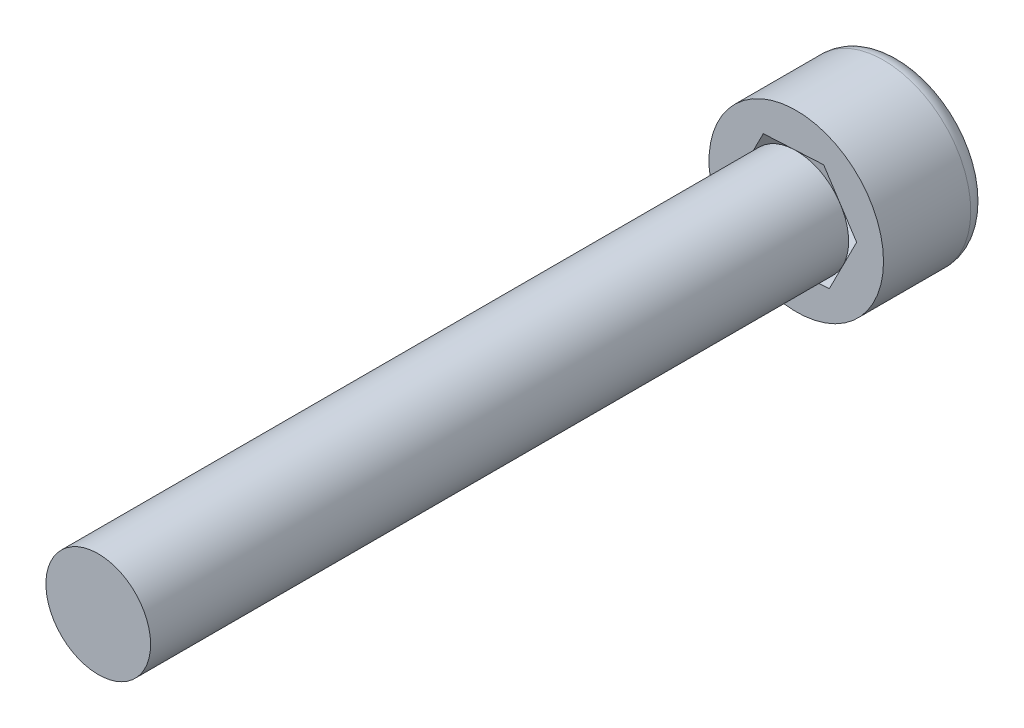
ISO-10303-21;
HEADER;
FILE_DESCRIPTION(('STEP AP214'),'2;1');
FILE_NAME('part.step','',(''),(''),'','','');
FILE_SCHEMA(('AUTOMOTIVE_DESIGN { 1 0 10303 214 1 1 1 1 }'));
ENDSEC;
DATA;
#1=APPLICATION_CONTEXT('core data for automotive mechanical design processes');
#2=APPLICATION_PROTOCOL_DEFINITION('international standard','automotive_design',2000,#1);
#3=PRODUCT_CONTEXT('',#1,'mechanical');
#4=PRODUCT('Part','Part','',(#3));
#5=PRODUCT_RELATED_PRODUCT_CATEGORY('part','',(#4));
#6=PRODUCT_DEFINITION_FORMATION('','',#4);
#7=PRODUCT_DEFINITION_CONTEXT('part definition',#1,'design');
#8=PRODUCT_DEFINITION('design','',#6,#7);
#9=PRODUCT_DEFINITION_SHAPE('','',#8);
#10=(LENGTH_UNIT() NAMED_UNIT(*) SI_UNIT(.MILLI.,.METRE.));
#11=(NAMED_UNIT(*) PLANE_ANGLE_UNIT() SI_UNIT($,.RADIAN.));
#12=(NAMED_UNIT(*) SI_UNIT($,.STERADIAN.) SOLID_ANGLE_UNIT());
#13=UNCERTAINTY_MEASURE_WITH_UNIT(LENGTH_MEASURE(1.E-05),#10,'distance_accuracy_value','');
#14=(GEOMETRIC_REPRESENTATION_CONTEXT(3) GLOBAL_UNCERTAINTY_ASSIGNED_CONTEXT((#13)) GLOBAL_UNIT_ASSIGNED_CONTEXT((#10,
#11,#12)) REPRESENTATION_CONTEXT('',''));
#15=CARTESIAN_POINT('',(0.,0.,0.));
#16=DIRECTION('',(0.,0.,1.));
#17=DIRECTION('',(1.,0.,0.));
#18=AXIS2_PLACEMENT_3D('',#15,#16,#17);
#19=CARTESIAN_POINT('',(0.,0.,3.));
#20=DIRECTION('',(0.,0.,-1.));
#21=DIRECTION('',(-1.,0.,0.));
#22=AXIS2_PLACEMENT_3D('',#19,#20,#21);
#23=CYLINDRICAL_SURFACE('',#22,2.5);
#24=CARTESIAN_POINT('',(0.,0.,0.5));
#25=DIRECTION('',(0.,0.,1.));
#26=DIRECTION('',(1.,0.,0.));
#27=AXIS2_PLACEMENT_3D('',#24,#25,#26);
#28=CIRCLE('',#27,2.5);
#29=CARTESIAN_POINT('',(2.5,0.,0.5));
#30=VERTEX_POINT('',#29);
#31=EDGE_CURVE('E50',#30,#30,#28,.T.);
#32=ORIENTED_EDGE('',*,*,#31,.T.);
#33=EDGE_LOOP('',(#32));
#34=FACE_BOUND('',#33,.T.);
#35=CARTESIAN_POINT('',(0.,0.,3.));
#36=DIRECTION('',(0.,0.,1.));
#37=DIRECTION('',(1.,0.,0.));
#38=AXIS2_PLACEMENT_3D('',#35,#36,#37);
#39=CIRCLE('',#38,2.5);
#40=CARTESIAN_POINT('',(2.5,0.,3.));
#41=VERTEX_POINT('',#40);
#42=EDGE_CURVE('E165',#41,#41,#39,.T.);
#43=ORIENTED_EDGE('',*,*,#42,.F.);
#44=EDGE_LOOP('',(#43));
#45=FACE_BOUND('',#44,.T.);
#46=ADVANCED_FACE('F41',(#34,#45),#23,.T.);
#47=CARTESIAN_POINT('',(0.,0.,3.));
#48=DIRECTION('',(0.,0.,1.));
#49=DIRECTION('',(1.,0.,0.));
#50=AXIS2_PLACEMENT_3D('',#47,#48,#49);
#51=PLANE('',#50);
#52=DIRECTION('',(-0.998565318577122,-0.0535472178079434,0.));
#53=VECTOR('',#52,1.);
#54=CARTESIAN_POINT('',(0.945103759937804,-1.45147472694203,3.));
#55=LINE('',#54,#53);
#56=CARTESIAN_POINT('',(0.945103759937804,-1.45147472694203,3.));
#57=VERTEX_POINT('',#56);
#58=CARTESIAN_POINT('',(-0.784462106513973,-1.54422122878934,3.));
#59=VERTEX_POINT('',#58);
#60=EDGE_CURVE('E94',#57,#59,#55,.T.);
#61=ORIENTED_EDGE('',*,*,#60,.T.);
#62=DIRECTION('',(-0.545655910212218,0.838009324321917,0.));
#63=VECTOR('',#62,1.);
#64=CARTESIAN_POINT('',(-0.784462106513973,-1.54422122878934,3.));
#65=LINE('',#64,#63);
#66=CARTESIAN_POINT('',(-1.72956586645178,-0.0927465018473138,3.));
#67=VERTEX_POINT('',#66);
#68=EDGE_CURVE('E57',#59,#67,#65,.T.);
#69=ORIENTED_EDGE('',*,*,#68,.T.);
#70=DIRECTION('',(0.452909408364904,0.89155654212986,0.));
#71=VECTOR('',#70,1.);
#72=CARTESIAN_POINT('',(-1.72956586645178,-0.0927465018473138,3.));
#73=LINE('',#72,#71);
#74=CARTESIAN_POINT('',(-0.945103759937803,1.45147472694203,3.));
#75=VERTEX_POINT('',#74);
#76=EDGE_CURVE('E104',#67,#75,#73,.T.);
#77=ORIENTED_EDGE('',*,*,#76,.T.);
#78=DIRECTION('',(0.998565318577122,0.0535472178079431,0.));
#79=VECTOR('',#78,1.);
#80=CARTESIAN_POINT('',(-0.945103759937803,1.45147472694203,3.));
#81=LINE('',#80,#79);
#82=CARTESIAN_POINT('',(0.784462106513974,1.54422122878934,3.));
#83=VERTEX_POINT('',#82);
#84=EDGE_CURVE('E176',#75,#83,#81,.T.);
#85=ORIENTED_EDGE('',*,*,#84,.T.);
#86=DIRECTION('',(0.545655910212218,-0.838009324321917,0.));
#87=VECTOR('',#86,1.);
#88=CARTESIAN_POINT('',(0.784462106513974,1.54422122878934,3.));
#89=LINE('',#88,#87);
#90=CARTESIAN_POINT('',(1.72956586645178,0.0927465018473145,3.));
#91=VERTEX_POINT('',#90);
#92=EDGE_CURVE('E174',#83,#91,#89,.T.);
#93=ORIENTED_EDGE('',*,*,#92,.T.);
#94=DIRECTION('',(-0.452909408364904,-0.89155654212986,0.));
#95=VECTOR('',#94,1.);
#96=CARTESIAN_POINT('',(1.72956586645178,0.0927465018473145,3.));
#97=LINE('',#96,#95);
#98=EDGE_CURVE('E109',#91,#57,#97,.T.);
#99=ORIENTED_EDGE('',*,*,#98,.T.);
#100=EDGE_LOOP('',(#61,#69,#77,#85,#93,#99));
#101=FACE_BOUND('',#100,.T.);
#102=ORIENTED_EDGE('',*,*,#42,.T.);
#103=EDGE_LOOP('',(#102));
#104=FACE_BOUND('',#103,.T.);
#105=ADVANCED_FACE('F106',(#101,#104),#51,.T.);
#106=CARTESIAN_POINT('',(0.,0.,0.));
#107=DIRECTION('',(0.,0.,1.));
#108=DIRECTION('',(1.,0.,0.));
#109=AXIS2_PLACEMENT_3D('',#106,#107,#108);
#110=PLANE('',#109);
#111=CARTESIAN_POINT('',(0.,0.,0.));
#112=DIRECTION('',(0.,0.,1.));
#113=DIRECTION('',(1.,0.,0.));
#114=AXIS2_PLACEMENT_3D('',#111,#112,#113);
#115=CIRCLE('',#114,2.);
#116=CARTESIAN_POINT('',(2.,0.,0.));
#117=VERTEX_POINT('',#116);
#118=EDGE_CURVE('E12',#117,#117,#115,.F.);
#119=ORIENTED_EDGE('',*,*,#118,.T.);
#120=EDGE_LOOP('',(#119));
#121=FACE_BOUND('',#120,.T.);
#122=DIRECTION('',(-0.545655910212218,0.838009324321917,0.));
#123=VECTOR('',#122,1.);
#124=CARTESIAN_POINT('',(-0.784462106513973,-1.54422122878934,0.));
#125=LINE('',#124,#123);
#126=CARTESIAN_POINT('',(-0.784462106513973,-1.54422122878934,0.));
#127=VERTEX_POINT('',#126);
#128=CARTESIAN_POINT('',(-1.72956586645178,-0.0927465018473138,0.));
#129=VERTEX_POINT('',#128);
#130=EDGE_CURVE('E99',#127,#129,#125,.T.);
#131=ORIENTED_EDGE('',*,*,#130,.F.);
#132=DIRECTION('',(-0.998565318577122,-0.0535472178079434,0.));
#133=VECTOR('',#132,1.);
#134=CARTESIAN_POINT('',(0.945103759937804,-1.45147472694203,0.));
#135=LINE('',#134,#133);
#136=CARTESIAN_POINT('',(0.945103759937804,-1.45147472694203,0.));
#137=VERTEX_POINT('',#136);
#138=EDGE_CURVE('E90',#137,#127,#135,.T.);
#139=ORIENTED_EDGE('',*,*,#138,.F.);
#140=DIRECTION('',(-0.452909408364904,-0.89155654212986,0.));
#141=VECTOR('',#140,1.);
#142=CARTESIAN_POINT('',(1.72956586645178,0.0927465018473145,0.));
#143=LINE('',#142,#141);
#144=CARTESIAN_POINT('',(1.72956586645178,0.0927465018473145,0.));
#145=VERTEX_POINT('',#144);
#146=EDGE_CURVE('E156',#145,#137,#143,.T.);
#147=ORIENTED_EDGE('',*,*,#146,.F.);
#148=DIRECTION('',(0.545655910212218,-0.838009324321917,0.));
#149=VECTOR('',#148,1.);
#150=CARTESIAN_POINT('',(0.784462106513974,1.54422122878934,0.));
#151=LINE('',#150,#149);
#152=CARTESIAN_POINT('',(0.784462106513974,1.54422122878934,0.));
#153=VERTEX_POINT('',#152);
#154=EDGE_CURVE('E189',#153,#145,#151,.T.);
#155=ORIENTED_EDGE('',*,*,#154,.F.);
#156=DIRECTION('',(0.998565318577122,0.0535472178079431,0.));
#157=VECTOR('',#156,1.);
#158=CARTESIAN_POINT('',(-0.945103759937803,1.45147472694203,0.));
#159=LINE('',#158,#157);
#160=CARTESIAN_POINT('',(-0.945103759937803,1.45147472694203,0.));
#161=VERTEX_POINT('',#160);
#162=EDGE_CURVE('E185',#161,#153,#159,.T.);
#163=ORIENTED_EDGE('',*,*,#162,.F.);
#164=DIRECTION('',(0.452909408364904,0.89155654212986,0.));
#165=VECTOR('',#164,1.);
#166=CARTESIAN_POINT('',(-1.72956586645178,-0.0927465018473138,0.));
#167=LINE('',#166,#165);
#168=EDGE_CURVE('E182',#129,#161,#167,.T.);
#169=ORIENTED_EDGE('',*,*,#168,.F.);
#170=EDGE_LOOP('',(#131,#139,#147,#155,#163,#169));
#171=FACE_BOUND('',#170,.T.);
#172=ADVANCED_FACE('F131',(#121,#171),#110,.F.);
#173=CARTESIAN_POINT('',(0.945103759937804,-1.45147472694203,3.));
#174=DIRECTION('',(0.0535472178079434,-0.998565318577122,0.));
#175=DIRECTION('',(0.998565318577122,0.0535472178079434,0.));
#176=AXIS2_PLACEMENT_3D('',#173,#174,#175);
#177=PLANE('',#176);
#178=ORIENTED_EDGE('',*,*,#138,.T.);
#179=DIRECTION('',(0.,0.,-1.));
#180=VECTOR('',#179,1.);
#181=CARTESIAN_POINT('',(-0.784462106513973,-1.54422122878934,3.));
#182=LINE('',#181,#180);
#183=EDGE_CURVE('E92',#59,#127,#182,.T.);
#184=ORIENTED_EDGE('',*,*,#183,.F.);
#185=ORIENTED_EDGE('',*,*,#60,.F.);
#186=DIRECTION('',(0.,0.,-1.));
#187=VECTOR('',#186,1.);
#188=CARTESIAN_POINT('',(0.945103759937804,-1.45147472694203,3.));
#189=LINE('',#188,#187);
#190=EDGE_CURVE('E157',#57,#137,#189,.T.);
#191=ORIENTED_EDGE('',*,*,#190,.T.);
#192=EDGE_LOOP('',(#178,#184,#185,#191));
#193=FACE_BOUND('',#192,.T.);
#194=ADVANCED_FACE('F93',(#193),#177,.F.);
#195=CARTESIAN_POINT('',(1.72956586645178,0.0927465018473145,3.));
#196=DIRECTION('',(0.89155654212986,-0.452909408364904,0.));
#197=DIRECTION('',(0.452909408364904,0.89155654212986,0.));
#198=AXIS2_PLACEMENT_3D('',#195,#196,#197);
#199=PLANE('',#198);
#200=ORIENTED_EDGE('',*,*,#146,.T.);
#201=ORIENTED_EDGE('',*,*,#190,.F.);
#202=ORIENTED_EDGE('',*,*,#98,.F.);
#203=DIRECTION('',(0.,0.,-1.));
#204=VECTOR('',#203,1.);
#205=CARTESIAN_POINT('',(1.72956586645178,0.0927465018473145,3.));
#206=LINE('',#205,#204);
#207=EDGE_CURVE('E159',#91,#145,#206,.T.);
#208=ORIENTED_EDGE('',*,*,#207,.T.);
#209=EDGE_LOOP('',(#200,#201,#202,#208));
#210=FACE_BOUND('',#209,.T.);
#211=ADVANCED_FACE('F138',(#210),#199,.F.);
#212=CARTESIAN_POINT('',(0.784462106513974,1.54422122878934,3.));
#213=DIRECTION('',(0.838009324321917,0.545655910212218,0.));
#214=DIRECTION('',(-0.545655910212218,0.838009324321917,0.));
#215=AXIS2_PLACEMENT_3D('',#212,#213,#214);
#216=PLANE('',#215);
#217=ORIENTED_EDGE('',*,*,#154,.T.);
#218=ORIENTED_EDGE('',*,*,#207,.F.);
#219=ORIENTED_EDGE('',*,*,#92,.F.);
#220=DIRECTION('',(0.,0.,-1.));
#221=VECTOR('',#220,1.);
#222=CARTESIAN_POINT('',(0.784462106513974,1.54422122878934,3.));
#223=LINE('',#222,#221);
#224=EDGE_CURVE('E187',#83,#153,#223,.T.);
#225=ORIENTED_EDGE('',*,*,#224,.T.);
#226=EDGE_LOOP('',(#217,#218,#219,#225));
#227=FACE_BOUND('',#226,.T.);
#228=ADVANCED_FACE('F146',(#227),#216,.F.);
#229=CARTESIAN_POINT('',(-0.945103759937803,1.45147472694203,3.));
#230=DIRECTION('',(-0.0535472178079431,0.998565318577122,0.));
#231=DIRECTION('',(-0.998565318577122,-0.0535472178079432,0.));
#232=AXIS2_PLACEMENT_3D('',#229,#230,#231);
#233=PLANE('',#232);
#234=ORIENTED_EDGE('',*,*,#162,.T.);
#235=ORIENTED_EDGE('',*,*,#224,.F.);
#236=ORIENTED_EDGE('',*,*,#84,.F.);
#237=DIRECTION('',(0.,0.,-1.));
#238=VECTOR('',#237,1.);
#239=CARTESIAN_POINT('',(-0.945103759937803,1.45147472694203,3.));
#240=LINE('',#239,#238);
#241=EDGE_CURVE('E181',#75,#161,#240,.T.);
#242=ORIENTED_EDGE('',*,*,#241,.T.);
#243=EDGE_LOOP('',(#234,#235,#236,#242));
#244=FACE_BOUND('',#243,.T.);
#245=ADVANCED_FACE('F142',(#244),#233,.F.);
#246=CARTESIAN_POINT('',(-1.72956586645178,-0.0927465018473138,3.));
#247=DIRECTION('',(-0.89155654212986,0.452909408364904,0.));
#248=DIRECTION('',(-0.452909408364904,-0.89155654212986,0.));
#249=AXIS2_PLACEMENT_3D('',#246,#247,#248);
#250=PLANE('',#249);
#251=ORIENTED_EDGE('',*,*,#168,.T.);
#252=ORIENTED_EDGE('',*,*,#241,.F.);
#253=ORIENTED_EDGE('',*,*,#76,.F.);
#254=DIRECTION('',(0.,0.,-1.));
#255=VECTOR('',#254,1.);
#256=CARTESIAN_POINT('',(-1.72956586645178,-0.0927465018473138,3.));
#257=LINE('',#256,#255);
#258=EDGE_CURVE('E102',#67,#129,#257,.T.);
#259=ORIENTED_EDGE('',*,*,#258,.T.);
#260=EDGE_LOOP('',(#251,#252,#253,#259));
#261=FACE_BOUND('',#260,.T.);
#262=ADVANCED_FACE('F123',(#261),#250,.F.);
#263=CARTESIAN_POINT('',(-0.784462106513973,-1.54422122878934,3.));
#264=DIRECTION('',(-0.838009324321917,-0.545655910212218,0.));
#265=DIRECTION('',(0.545655910212218,-0.838009324321917,0.));
#266=AXIS2_PLACEMENT_3D('',#263,#264,#265);
#267=PLANE('',#266);
#268=ORIENTED_EDGE('',*,*,#130,.T.);
#269=ORIENTED_EDGE('',*,*,#258,.F.);
#270=ORIENTED_EDGE('',*,*,#68,.F.);
#271=ORIENTED_EDGE('',*,*,#183,.T.);
#272=EDGE_LOOP('',(#268,#269,#270,#271));
#273=FACE_BOUND('',#272,.T.);
#274=ADVANCED_FACE('F101',(#273),#267,.F.);
#275=CARTESIAN_POINT('',(0.,0.,0.5));
#276=DIRECTION('',(0.,0.,1.));
#277=DIRECTION('',(1.,0.,0.));
#278=AXIS2_PLACEMENT_3D('',#275,#276,#277);
#279=TOROIDAL_SURFACE('',#278,2.,0.5);
#280=ORIENTED_EDGE('',*,*,#118,.F.);
#281=EDGE_LOOP('',(#280));
#282=FACE_BOUND('',#281,.T.);
#283=ORIENTED_EDGE('',*,*,#31,.F.);
#284=EDGE_LOOP('',(#283));
#285=FACE_BOUND('',#284,.T.);
#286=ADVANCED_FACE('F43',(#282,#285),#279,.T.);
#287=CLOSED_SHELL('',(#46,#105,#172,#194,#211,#228,#245,#262,#274,#286));
#288=MANIFOLD_SOLID_BREP('B2',#287);
#289=CARTESIAN_POINT('',(0.,0.,23.));
#290=DIRECTION('',(0.,0.,1.));
#291=DIRECTION('',(1.,0.,0.));
#292=AXIS2_PLACEMENT_3D('',#289,#290,#291);
#293=PLANE('',#292);
#294=CARTESIAN_POINT('',(0.,0.,23.));
#295=DIRECTION('',(0.,0.,1.));
#296=DIRECTION('',(1.,0.,0.));
#297=AXIS2_PLACEMENT_3D('',#294,#295,#296);
#298=CIRCLE('',#297,1.5);
#299=CARTESIAN_POINT('',(1.5,0.,23.));
#300=VERTEX_POINT('',#299);
#301=EDGE_CURVE('E260',#300,#300,#298,.T.);
#302=ORIENTED_EDGE('',*,*,#301,.T.);
#303=EDGE_LOOP('',(#302));
#304=FACE_BOUND('',#303,.T.);
#305=ADVANCED_FACE('F253',(#304),#293,.T.);
#306=CARTESIAN_POINT('',(0.,0.,23.));
#307=DIRECTION('',(0.,0.,-1.));
#308=DIRECTION('',(-1.,0.,0.));
#309=AXIS2_PLACEMENT_3D('',#306,#307,#308);
#310=CYLINDRICAL_SURFACE('',#309,1.5);
#311=ORIENTED_EDGE('',*,*,#301,.F.);
#312=EDGE_LOOP('',(#311));
#313=FACE_BOUND('',#312,.T.);
#314=CARTESIAN_POINT('',(0.,0.,3.));
#315=DIRECTION('',(0.,0.,1.));
#316=DIRECTION('',(1.,0.,0.));
#317=AXIS2_PLACEMENT_3D('',#314,#315,#316);
#318=CIRCLE('',#317,1.5);
#319=CARTESIAN_POINT('',(1.5,0.,3.));
#320=VERTEX_POINT('',#319);
#321=EDGE_CURVE('E40',#320,#320,#318,.T.);
#322=ORIENTED_EDGE('',*,*,#321,.T.);
#323=EDGE_LOOP('',(#322));
#324=FACE_BOUND('',#323,.T.);
#325=ADVANCED_FACE('F255',(#313,#324),#310,.T.);
#326=CARTESIAN_POINT('',(0.,0.,3.));
#327=DIRECTION('',(0.,0.,-1.));
#328=DIRECTION('',(-1.,0.,0.));
#329=AXIS2_PLACEMENT_3D('',#326,#327,#328);
#330=PLANE('',#329);
#331=ORIENTED_EDGE('',*,*,#321,.F.);
#332=EDGE_LOOP('',(#331));
#333=FACE_BOUND('',#332,.T.);
#334=ADVANCED_FACE('F268',(#333),#330,.T.);
#335=CLOSED_SHELL('',(#305,#325,#334));
#336=MANIFOLD_SOLID_BREP('B6',#335);
#337=ADVANCED_BREP_SHAPE_REPRESENTATION('',(#18,#288,#336),#14);
#338=SHAPE_DEFINITION_REPRESENTATION(#9,#337);
ENDSEC;
END-ISO-10303-21;
